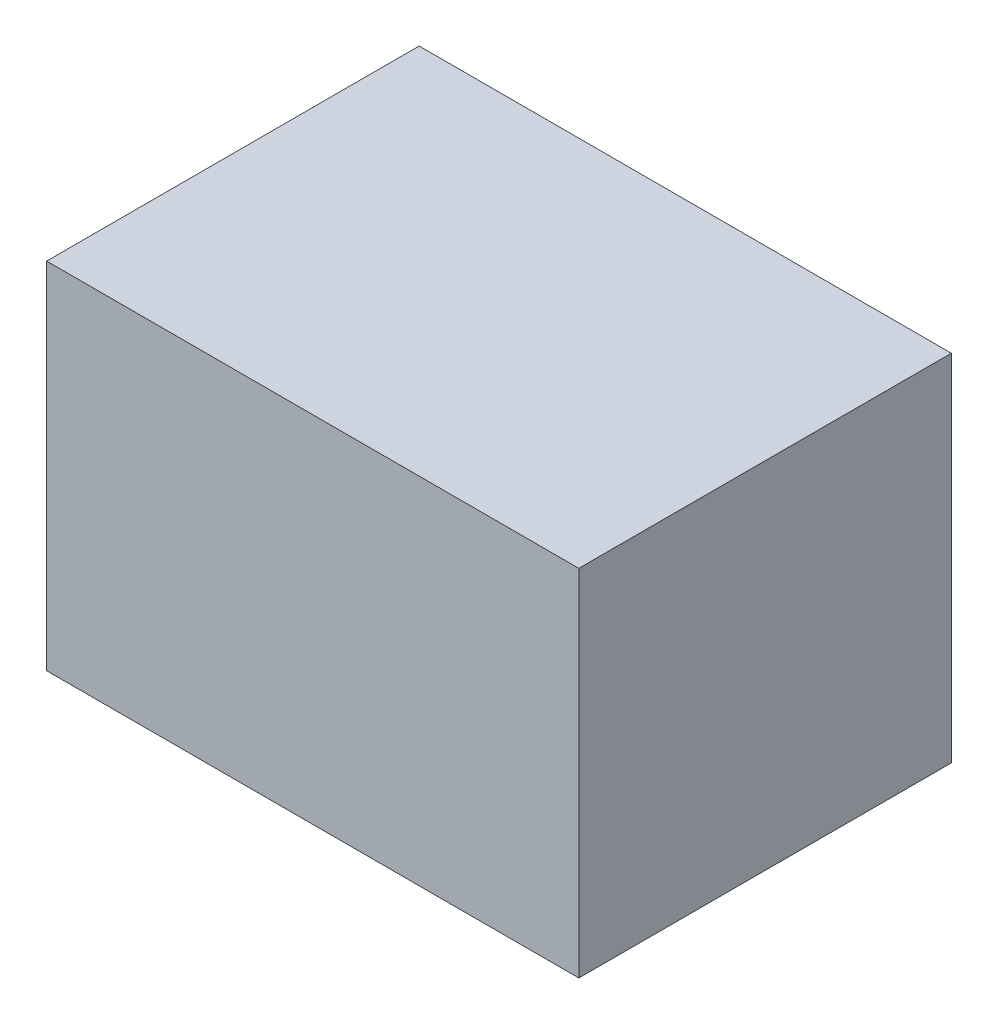
ISO-10303-21;
HEADER;
FILE_DESCRIPTION(('STEP AP214'),'2;1');
FILE_NAME('part.step','',(''),(''),'','','');
FILE_SCHEMA(('AUTOMOTIVE_DESIGN { 1 0 10303 214 1 1 1 1 }'));
ENDSEC;
DATA;
#1=APPLICATION_CONTEXT('core data for automotive mechanical design processes');
#2=APPLICATION_PROTOCOL_DEFINITION('international standard','automotive_design',2000,#1);
#3=PRODUCT_CONTEXT('',#1,'mechanical');
#4=PRODUCT('Part','Part','',(#3));
#5=PRODUCT_RELATED_PRODUCT_CATEGORY('part','',(#4));
#6=PRODUCT_DEFINITION_FORMATION('','',#4);
#7=PRODUCT_DEFINITION_CONTEXT('part definition',#1,'design');
#8=PRODUCT_DEFINITION('design','',#6,#7);
#9=PRODUCT_DEFINITION_SHAPE('','',#8);
#10=(LENGTH_UNIT() NAMED_UNIT(*) SI_UNIT(.MILLI.,.METRE.));
#11=(NAMED_UNIT(*) PLANE_ANGLE_UNIT() SI_UNIT($,.RADIAN.));
#12=(NAMED_UNIT(*) SI_UNIT($,.STERADIAN.) SOLID_ANGLE_UNIT());
#13=UNCERTAINTY_MEASURE_WITH_UNIT(LENGTH_MEASURE(1.E-05),#10,'distance_accuracy_value','');
#14=(GEOMETRIC_REPRESENTATION_CONTEXT(3) GLOBAL_UNCERTAINTY_ASSIGNED_CONTEXT((#13)) GLOBAL_UNIT_ASSIGNED_CONTEXT((#10,
#11,#12)) REPRESENTATION_CONTEXT('',''));
#15=CARTESIAN_POINT('',(0.,0.,0.));
#16=DIRECTION('',(0.,0.,1.));
#17=DIRECTION('',(1.,0.,0.));
#18=AXIS2_PLACEMENT_3D('',#15,#16,#17);
#19=CARTESIAN_POINT('',(0.,0.,-5.08));
#20=DIRECTION('',(-1.,0.,0.));
#21=DIRECTION('',(0.,0.,1.));
#22=AXIS2_PLACEMENT_3D('',#19,#20,#21);
#23=PLANE('',#22);
#24=DIRECTION('',(0.,0.,1.));
#25=VECTOR('',#24,1.);
#26=CARTESIAN_POINT('',(0.,0.,-5.08));
#27=LINE('',#26,#25);
#28=CARTESIAN_POINT('',(0.,0.,-5.08));
#29=VERTEX_POINT('',#28);
#30=CARTESIAN_POINT('',(0.,0.,101.6));
#31=VERTEX_POINT('',#30);
#32=EDGE_CURVE('E35',#29,#31,#27,.T.);
#33=ORIENTED_EDGE('',*,*,#32,.T.);
#34=DIRECTION('',(0.,-1.,0.));
#35=VECTOR('',#34,1.);
#36=CARTESIAN_POINT('',(0.,0.,101.6));
#37=LINE('',#36,#35);
#38=CARTESIAN_POINT('',(0.,101.6,101.6));
#39=VERTEX_POINT('',#38);
#40=EDGE_CURVE('E72',#39,#31,#37,.T.);
#41=ORIENTED_EDGE('',*,*,#40,.F.);
#42=DIRECTION('',(0.,0.,1.));
#43=VECTOR('',#42,1.);
#44=CARTESIAN_POINT('',(0.,101.6,-5.08));
#45=LINE('',#44,#43);
#46=CARTESIAN_POINT('',(0.,101.6,-5.08));
#47=VERTEX_POINT('',#46);
#48=EDGE_CURVE('E11',#47,#39,#45,.T.);
#49=ORIENTED_EDGE('',*,*,#48,.F.);
#50=DIRECTION('',(0.,-1.,0.));
#51=VECTOR('',#50,1.);
#52=CARTESIAN_POINT('',(0.,0.,-5.08));
#53=LINE('',#52,#51);
#54=EDGE_CURVE('E73',#47,#29,#53,.T.);
#55=ORIENTED_EDGE('',*,*,#54,.T.);
#56=EDGE_LOOP('',(#33,#41,#49,#55));
#57=FACE_BOUND('',#56,.T.);
#58=ADVANCED_FACE('F32',(#57),#23,.T.);
#59=CARTESIAN_POINT('',(0.,101.6,-5.08));
#60=DIRECTION('',(0.,1.,0.));
#61=DIRECTION('',(0.,0.,1.));
#62=AXIS2_PLACEMENT_3D('',#59,#60,#61);
#63=PLANE('',#62);
#64=ORIENTED_EDGE('',*,*,#48,.T.);
#65=DIRECTION('',(-1.,0.,0.));
#66=VECTOR('',#65,1.);
#67=CARTESIAN_POINT('',(0.,101.6,101.6));
#68=LINE('',#67,#66);
#69=CARTESIAN_POINT('',(152.4,101.6,101.6));
#70=VERTEX_POINT('',#69);
#71=EDGE_CURVE('E89',#70,#39,#68,.T.);
#72=ORIENTED_EDGE('',*,*,#71,.F.);
#73=DIRECTION('',(0.,0.,1.));
#74=VECTOR('',#73,1.);
#75=CARTESIAN_POINT('',(152.4,101.6,-5.08));
#76=LINE('',#75,#74);
#77=CARTESIAN_POINT('',(152.4,101.6,-5.08));
#78=VERTEX_POINT('',#77);
#79=EDGE_CURVE('E40',#78,#70,#76,.T.);
#80=ORIENTED_EDGE('',*,*,#79,.F.);
#81=DIRECTION('',(-1.,0.,0.));
#82=VECTOR('',#81,1.);
#83=CARTESIAN_POINT('',(0.,101.6,-5.08));
#84=LINE('',#83,#82);
#85=EDGE_CURVE('E78',#78,#47,#84,.T.);
#86=ORIENTED_EDGE('',*,*,#85,.T.);
#87=EDGE_LOOP('',(#64,#72,#80,#86));
#88=FACE_BOUND('',#87,.T.);
#89=ADVANCED_FACE('F109',(#88),#63,.T.);
#90=CARTESIAN_POINT('',(152.4,0.,-5.08));
#91=DIRECTION('',(1.,0.,0.));
#92=DIRECTION('',(0.,0.,-1.));
#93=AXIS2_PLACEMENT_3D('',#90,#91,#92);
#94=PLANE('',#93);
#95=ORIENTED_EDGE('',*,*,#79,.T.);
#96=DIRECTION('',(0.,1.,0.));
#97=VECTOR('',#96,1.);
#98=CARTESIAN_POINT('',(152.4,0.,101.6));
#99=LINE('',#98,#97);
#100=CARTESIAN_POINT('',(152.4,0.,101.6));
#101=VERTEX_POINT('',#100);
#102=EDGE_CURVE('E85',#101,#70,#99,.T.);
#103=ORIENTED_EDGE('',*,*,#102,.F.);
#104=DIRECTION('',(0.,0.,1.));
#105=VECTOR('',#104,1.);
#106=CARTESIAN_POINT('',(152.4,0.,-5.08));
#107=LINE('',#106,#105);
#108=CARTESIAN_POINT('',(152.4,0.,-5.08));
#109=VERTEX_POINT('',#108);
#110=EDGE_CURVE('E77',#109,#101,#107,.T.);
#111=ORIENTED_EDGE('',*,*,#110,.F.);
#112=DIRECTION('',(0.,1.,0.));
#113=VECTOR('',#112,1.);
#114=CARTESIAN_POINT('',(152.4,0.,-5.08));
#115=LINE('',#114,#113);
#116=EDGE_CURVE('E102',#109,#78,#115,.T.);
#117=ORIENTED_EDGE('',*,*,#116,.T.);
#118=EDGE_LOOP('',(#95,#103,#111,#117));
#119=FACE_BOUND('',#118,.T.);
#120=ADVANCED_FACE('F106',(#119),#94,.T.);
#121=CARTESIAN_POINT('',(0.,0.,-5.08));
#122=DIRECTION('',(0.,-1.,0.));
#123=DIRECTION('',(0.,0.,-1.));
#124=AXIS2_PLACEMENT_3D('',#121,#122,#123);
#125=PLANE('',#124);
#126=ORIENTED_EDGE('',*,*,#110,.T.);
#127=DIRECTION('',(1.,0.,0.));
#128=VECTOR('',#127,1.);
#129=CARTESIAN_POINT('',(0.,0.,101.6));
#130=LINE('',#129,#128);
#131=EDGE_CURVE('E80',#31,#101,#130,.T.);
#132=ORIENTED_EDGE('',*,*,#131,.F.);
#133=ORIENTED_EDGE('',*,*,#32,.F.);
#134=DIRECTION('',(1.,0.,0.));
#135=VECTOR('',#134,1.);
#136=CARTESIAN_POINT('',(0.,0.,-5.08));
#137=LINE('',#136,#135);
#138=EDGE_CURVE('E100',#29,#109,#137,.T.);
#139=ORIENTED_EDGE('',*,*,#138,.T.);
#140=EDGE_LOOP('',(#126,#132,#133,#139));
#141=FACE_BOUND('',#140,.T.);
#142=ADVANCED_FACE('F81',(#141),#125,.T.);
#143=CARTESIAN_POINT('',(0.,0.,-5.08));
#144=DIRECTION('',(0.,0.,-1.));
#145=DIRECTION('',(-1.,0.,0.));
#146=AXIS2_PLACEMENT_3D('',#143,#144,#145);
#147=PLANE('',#146);
#148=CARTESIAN_POINT('',(76.2,50.8,-5.08));
#149=DIRECTION('',(0.,0.,-1.));
#150=DIRECTION('',(-1.,0.,0.));
#151=AXIS2_PLACEMENT_3D('',#148,#149,#150);
#152=CIRCLE('',#151,12.954);
#153=CARTESIAN_POINT('',(63.246,50.8,-5.08));
#154=VERTEX_POINT('',#153);
#155=EDGE_CURVE('E93',#154,#154,#152,.T.);
#156=ORIENTED_EDGE('',*,*,#155,.F.);
#157=EDGE_LOOP('',(#156));
#158=FACE_BOUND('',#157,.T.);
#159=ORIENTED_EDGE('',*,*,#54,.F.);
#160=ORIENTED_EDGE('',*,*,#85,.F.);
#161=ORIENTED_EDGE('',*,*,#116,.F.);
#162=ORIENTED_EDGE('',*,*,#138,.F.);
#163=EDGE_LOOP('',(#159,#160,#161,#162));
#164=FACE_BOUND('',#163,.T.);
#165=ADVANCED_FACE('F111',(#158,#164),#147,.T.);
#166=CARTESIAN_POINT('',(0.,0.,101.6));
#167=DIRECTION('',(0.,0.,-1.));
#168=DIRECTION('',(-1.,0.,0.));
#169=AXIS2_PLACEMENT_3D('',#166,#167,#168);
#170=PLANE('',#169);
#171=ORIENTED_EDGE('',*,*,#40,.T.);
#172=ORIENTED_EDGE('',*,*,#131,.T.);
#173=ORIENTED_EDGE('',*,*,#102,.T.);
#174=ORIENTED_EDGE('',*,*,#71,.T.);
#175=EDGE_LOOP('',(#171,#172,#173,#174));
#176=FACE_BOUND('',#175,.T.);
#177=ADVANCED_FACE('F88',(#176),#170,.F.);
#178=CARTESIAN_POINT('',(76.2,50.8,96.52));
#179=DIRECTION('',(0.,0.,-1.));
#180=DIRECTION('',(-1.,0.,0.));
#181=AXIS2_PLACEMENT_3D('',#178,#179,#180);
#182=CYLINDRICAL_SURFACE('',#181,12.954);
#183=CARTESIAN_POINT('',(76.2,50.8,96.52));
#184=DIRECTION('',(0.,0.,-1.));
#185=DIRECTION('',(-1.,0.,0.));
#186=AXIS2_PLACEMENT_3D('',#183,#184,#185);
#187=CIRCLE('',#186,12.954);
#188=CARTESIAN_POINT('',(63.246,50.8,96.52));
#189=VERTEX_POINT('',#188);
#190=EDGE_CURVE('E90',#189,#189,#187,.T.);
#191=ORIENTED_EDGE('',*,*,#190,.F.);
#192=EDGE_LOOP('',(#191));
#193=FACE_BOUND('',#192,.T.);
#194=ORIENTED_EDGE('',*,*,#155,.T.);
#195=EDGE_LOOP('',(#194));
#196=FACE_BOUND('',#195,.T.);
#197=ADVANCED_FACE('F119',(#193,#196),#182,.F.);
#198=CARTESIAN_POINT('',(76.2,50.8,96.52));
#199=DIRECTION('',(0.,0.,-1.));
#200=DIRECTION('',(-1.,0.,0.));
#201=AXIS2_PLACEMENT_3D('',#198,#199,#200);
#202=PLANE('',#201);
#203=ORIENTED_EDGE('',*,*,#190,.T.);
#204=EDGE_LOOP('',(#203));
#205=FACE_BOUND('',#204,.T.);
#206=ADVANCED_FACE('F156',(#205),#202,.T.);
#207=CLOSED_SHELL('',(#58,#89,#120,#142,#165,#177,#197,#206));
#208=MANIFOLD_SOLID_BREP('B2',#207);
#209=ADVANCED_BREP_SHAPE_REPRESENTATION('',(#18,#208),#14);
#210=SHAPE_DEFINITION_REPRESENTATION(#9,#209);
ENDSEC;
END-ISO-10303-21;
